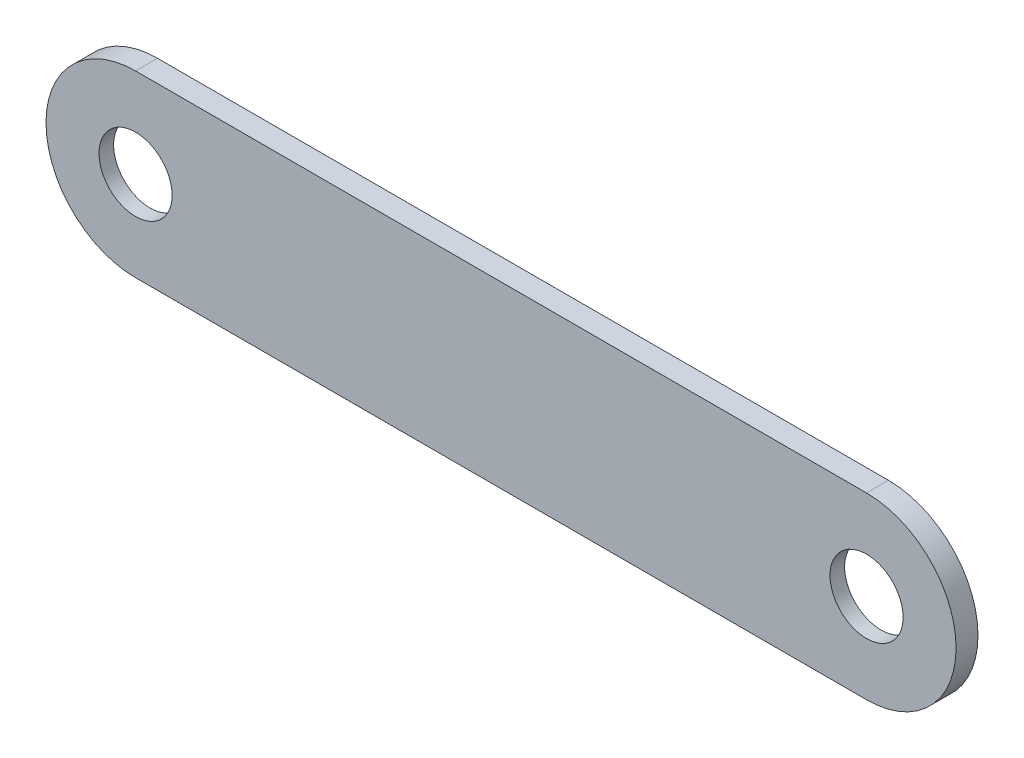
ISO-10303-21;
HEADER;
FILE_DESCRIPTION(('STEP AP214'),'2;1');
FILE_NAME('part.step','',(''),(''),'','','');
FILE_SCHEMA(('AUTOMOTIVE_DESIGN { 1 0 10303 214 1 1 1 1 }'));
ENDSEC;
DATA;
#1=APPLICATION_CONTEXT('core data for automotive mechanical design processes');
#2=APPLICATION_PROTOCOL_DEFINITION('international standard','automotive_design',2000,#1);
#3=PRODUCT_CONTEXT('',#1,'mechanical');
#4=PRODUCT('Part','Part','',(#3));
#5=PRODUCT_RELATED_PRODUCT_CATEGORY('part','',(#4));
#6=PRODUCT_DEFINITION_FORMATION('','',#4);
#7=PRODUCT_DEFINITION_CONTEXT('part definition',#1,'design');
#8=PRODUCT_DEFINITION('design','',#6,#7);
#9=PRODUCT_DEFINITION_SHAPE('','',#8);
#10=(LENGTH_UNIT() NAMED_UNIT(*) SI_UNIT(.MILLI.,.METRE.));
#11=(NAMED_UNIT(*) PLANE_ANGLE_UNIT() SI_UNIT($,.RADIAN.));
#12=(NAMED_UNIT(*) SI_UNIT($,.STERADIAN.) SOLID_ANGLE_UNIT());
#13=UNCERTAINTY_MEASURE_WITH_UNIT(LENGTH_MEASURE(1.E-05),#10,'distance_accuracy_value','');
#14=(GEOMETRIC_REPRESENTATION_CONTEXT(3) GLOBAL_UNCERTAINTY_ASSIGNED_CONTEXT((#13)) GLOBAL_UNIT_ASSIGNED_CONTEXT((#10,
#11,#12)) REPRESENTATION_CONTEXT('',''));
#15=CARTESIAN_POINT('',(0.,0.,0.));
#16=DIRECTION('',(0.,0.,1.));
#17=DIRECTION('',(1.,0.,0.));
#18=AXIS2_PLACEMENT_3D('',#15,#16,#17);
#19=CARTESIAN_POINT('',(0.,0.,3.));
#20=DIRECTION('',(0.,0.,1.));
#21=DIRECTION('',(1.,0.,0.));
#22=AXIS2_PLACEMENT_3D('',#19,#20,#21);
#23=PLANE('',#22);
#24=CARTESIAN_POINT('',(0.,0.,3.));
#25=DIRECTION('',(0.,0.,1.));
#26=DIRECTION('',(1.,0.,0.));
#27=AXIS2_PLACEMENT_3D('',#24,#25,#26);
#28=CIRCLE('',#27,5.);
#29=CARTESIAN_POINT('',(5.,0.,3.));
#30=VERTEX_POINT('',#29);
#31=EDGE_CURVE('E117',#30,#30,#28,.T.);
#32=ORIENTED_EDGE('',*,*,#31,.F.);
#33=EDGE_LOOP('',(#32));
#34=FACE_BOUND('',#33,.T.);
#35=CARTESIAN_POINT('',(0.,0.,3.));
#36=DIRECTION('',(0.,0.,1.));
#37=DIRECTION('',(1.,0.,0.));
#38=AXIS2_PLACEMENT_3D('',#35,#36,#37);
#39=CIRCLE('',#38,12.2500000000014);
#40=CARTESIAN_POINT('',(0.,12.2500000000014,3.));
#41=VERTEX_POINT('',#40);
#42=CARTESIAN_POINT('',(0.,-12.2500000000014,3.));
#43=VERTEX_POINT('',#42);
#44=EDGE_CURVE('E96',#41,#43,#39,.T.);
#45=ORIENTED_EDGE('',*,*,#44,.T.);
#46=DIRECTION('',(1.,0.,0.));
#47=VECTOR('',#46,1.);
#48=CARTESIAN_POINT('',(0.,-12.2500000000014,3.));
#49=LINE('',#48,#47);
#50=CARTESIAN_POINT('',(100.,-12.25,3.));
#51=VERTEX_POINT('',#50);
#52=EDGE_CURVE('E91',#43,#51,#49,.T.);
#53=ORIENTED_EDGE('',*,*,#52,.T.);
#54=CARTESIAN_POINT('',(100.,1.39659253553725E-12,3.));
#55=DIRECTION('',(0.,0.,1.));
#56=DIRECTION('',(1.,0.,0.));
#57=AXIS2_PLACEMENT_3D('',#54,#55,#56);
#58=CIRCLE('',#57,12.2500000000014);
#59=CARTESIAN_POINT('',(100.,12.2500000000014,3.));
#60=VERTEX_POINT('',#59);
#61=EDGE_CURVE('E94',#51,#60,#58,.T.);
#62=ORIENTED_EDGE('',*,*,#61,.T.);
#63=DIRECTION('',(-1.,0.,0.));
#64=VECTOR('',#63,1.);
#65=CARTESIAN_POINT('',(0.,12.2500000000014,3.));
#66=LINE('',#65,#64);
#67=EDGE_CURVE('E61',#60,#41,#66,.T.);
#68=ORIENTED_EDGE('',*,*,#67,.T.);
#69=EDGE_LOOP('',(#45,#53,#62,#68));
#70=FACE_BOUND('',#69,.T.);
#71=CARTESIAN_POINT('',(100.,1.39659253553725E-12,3.));
#72=DIRECTION('',(0.,0.,1.));
#73=DIRECTION('',(1.,0.,0.));
#74=AXIS2_PLACEMENT_3D('',#71,#72,#73);
#75=CIRCLE('',#74,5.);
#76=CARTESIAN_POINT('',(105.,1.39659253553725E-12,3.));
#77=VERTEX_POINT('',#76);
#78=EDGE_CURVE('E143',#77,#77,#75,.T.);
#79=ORIENTED_EDGE('',*,*,#78,.F.);
#80=EDGE_LOOP('',(#79));
#81=FACE_BOUND('',#80,.T.);
#82=ADVANCED_FACE('F41',(#34,#70,#81),#23,.T.);
#83=CARTESIAN_POINT('',(0.,0.,0.));
#84=DIRECTION('',(0.,0.,1.));
#85=DIRECTION('',(1.,0.,0.));
#86=AXIS2_PLACEMENT_3D('',#83,#84,#85);
#87=PLANE('',#86);
#88=CARTESIAN_POINT('',(0.,0.,0.));
#89=DIRECTION('',(0.,0.,1.));
#90=DIRECTION('',(1.,0.,0.));
#91=AXIS2_PLACEMENT_3D('',#88,#89,#90);
#92=CIRCLE('',#91,7.5);
#93=CARTESIAN_POINT('',(7.5,0.,0.));
#94=VERTEX_POINT('',#93);
#95=EDGE_CURVE('E45',#94,#94,#92,.T.);
#96=ORIENTED_EDGE('',*,*,#95,.T.);
#97=EDGE_LOOP('',(#96));
#98=FACE_BOUND('',#97,.T.);
#99=CARTESIAN_POINT('',(100.,1.39659253553725E-12,0.));
#100=DIRECTION('',(0.,0.,1.));
#101=DIRECTION('',(1.,0.,0.));
#102=AXIS2_PLACEMENT_3D('',#99,#100,#101);
#103=CIRCLE('',#102,7.5);
#104=CARTESIAN_POINT('',(107.5,1.39659253553725E-12,0.));
#105=VERTEX_POINT('',#104);
#106=EDGE_CURVE('E136',#105,#105,#103,.T.);
#107=ORIENTED_EDGE('',*,*,#106,.T.);
#108=EDGE_LOOP('',(#107));
#109=FACE_BOUND('',#108,.T.);
#110=CARTESIAN_POINT('',(0.,0.,0.));
#111=DIRECTION('',(0.,0.,1.));
#112=DIRECTION('',(1.,0.,0.));
#113=AXIS2_PLACEMENT_3D('',#110,#111,#112);
#114=CIRCLE('',#113,12.2500000000014);
#115=CARTESIAN_POINT('',(0.,12.2500000000014,0.));
#116=VERTEX_POINT('',#115);
#117=CARTESIAN_POINT('',(0.,-12.2500000000014,0.));
#118=VERTEX_POINT('',#117);
#119=EDGE_CURVE('E113',#116,#118,#114,.T.);
#120=ORIENTED_EDGE('',*,*,#119,.F.);
#121=DIRECTION('',(-1.,0.,0.));
#122=VECTOR('',#121,1.);
#123=CARTESIAN_POINT('',(0.,12.2500000000014,0.));
#124=LINE('',#123,#122);
#125=CARTESIAN_POINT('',(100.,12.2500000000014,0.));
#126=VERTEX_POINT('',#125);
#127=EDGE_CURVE('E84',#126,#116,#124,.T.);
#128=ORIENTED_EDGE('',*,*,#127,.F.);
#129=CARTESIAN_POINT('',(100.,1.39659253553725E-12,0.));
#130=DIRECTION('',(0.,0.,1.));
#131=DIRECTION('',(1.,0.,0.));
#132=AXIS2_PLACEMENT_3D('',#129,#130,#131);
#133=CIRCLE('',#132,12.2500000000014);
#134=CARTESIAN_POINT('',(100.,-12.25,0.));
#135=VERTEX_POINT('',#134);
#136=EDGE_CURVE('E78',#135,#126,#133,.T.);
#137=ORIENTED_EDGE('',*,*,#136,.F.);
#138=DIRECTION('',(1.,0.,0.));
#139=VECTOR('',#138,1.);
#140=CARTESIAN_POINT('',(0.,-12.2500000000014,0.));
#141=LINE('',#140,#139);
#142=EDGE_CURVE('E101',#118,#135,#141,.T.);
#143=ORIENTED_EDGE('',*,*,#142,.F.);
#144=EDGE_LOOP('',(#120,#128,#137,#143));
#145=FACE_BOUND('',#144,.T.);
#146=ADVANCED_FACE('F177',(#98,#109,#145),#87,.F.);
#147=CARTESIAN_POINT('',(0.,0.,3.));
#148=DIRECTION('',(0.,0.,-1.));
#149=DIRECTION('',(-1.,0.,0.));
#150=AXIS2_PLACEMENT_3D('',#147,#148,#149);
#151=CYLINDRICAL_SURFACE('',#150,12.2500000000014);
#152=ORIENTED_EDGE('',*,*,#119,.T.);
#153=DIRECTION('',(0.,0.,-1.));
#154=VECTOR('',#153,1.);
#155=CARTESIAN_POINT('',(0.,-12.2500000000014,3.));
#156=LINE('',#155,#154);
#157=EDGE_CURVE('E11',#43,#118,#156,.T.);
#158=ORIENTED_EDGE('',*,*,#157,.F.);
#159=ORIENTED_EDGE('',*,*,#44,.F.);
#160=DIRECTION('',(0.,0.,-1.));
#161=VECTOR('',#160,1.);
#162=CARTESIAN_POINT('',(0.,12.2500000000014,3.));
#163=LINE('',#162,#161);
#164=EDGE_CURVE('E109',#41,#116,#163,.T.);
#165=ORIENTED_EDGE('',*,*,#164,.T.);
#166=EDGE_LOOP('',(#152,#158,#159,#165));
#167=FACE_BOUND('',#166,.T.);
#168=ADVANCED_FACE('F43',(#167),#151,.T.);
#169=CARTESIAN_POINT('',(0.,-12.2500000000014,3.));
#170=DIRECTION('',(0.,1.,0.));
#171=DIRECTION('',(0.,0.,1.));
#172=AXIS2_PLACEMENT_3D('',#169,#170,#171);
#173=PLANE('',#172);
#174=ORIENTED_EDGE('',*,*,#142,.T.);
#175=DIRECTION('',(0.,0.,-1.));
#176=VECTOR('',#175,1.);
#177=CARTESIAN_POINT('',(100.,-12.25,3.));
#178=LINE('',#177,#176);
#179=EDGE_CURVE('E52',#51,#135,#178,.T.);
#180=ORIENTED_EDGE('',*,*,#179,.F.);
#181=ORIENTED_EDGE('',*,*,#52,.F.);
#182=ORIENTED_EDGE('',*,*,#157,.T.);
#183=EDGE_LOOP('',(#174,#180,#181,#182));
#184=FACE_BOUND('',#183,.T.);
#185=ADVANCED_FACE('F100',(#184),#173,.F.);
#186=CARTESIAN_POINT('',(100.,1.39659253553725E-12,3.));
#187=DIRECTION('',(0.,0.,-1.));
#188=DIRECTION('',(-1.,0.,0.));
#189=AXIS2_PLACEMENT_3D('',#186,#187,#188);
#190=CYLINDRICAL_SURFACE('',#189,12.2500000000014);
#191=ORIENTED_EDGE('',*,*,#136,.T.);
#192=DIRECTION('',(0.,0.,-1.));
#193=VECTOR('',#192,1.);
#194=CARTESIAN_POINT('',(100.,12.2500000000014,3.));
#195=LINE('',#194,#193);
#196=EDGE_CURVE('E103',#60,#126,#195,.T.);
#197=ORIENTED_EDGE('',*,*,#196,.F.);
#198=ORIENTED_EDGE('',*,*,#61,.F.);
#199=ORIENTED_EDGE('',*,*,#179,.T.);
#200=EDGE_LOOP('',(#191,#197,#198,#199));
#201=FACE_BOUND('',#200,.T.);
#202=ADVANCED_FACE('F105',(#201),#190,.T.);
#203=CARTESIAN_POINT('',(0.,12.2500000000014,3.));
#204=DIRECTION('',(0.,-1.,0.));
#205=DIRECTION('',(0.,0.,-1.));
#206=AXIS2_PLACEMENT_3D('',#203,#204,#205);
#207=PLANE('',#206);
#208=ORIENTED_EDGE('',*,*,#127,.T.);
#209=ORIENTED_EDGE('',*,*,#164,.F.);
#210=ORIENTED_EDGE('',*,*,#67,.F.);
#211=ORIENTED_EDGE('',*,*,#196,.T.);
#212=EDGE_LOOP('',(#208,#209,#210,#211));
#213=FACE_BOUND('',#212,.T.);
#214=ADVANCED_FACE('F189',(#213),#207,.F.);
#215=CARTESIAN_POINT('',(0.,0.,3.));
#216=DIRECTION('',(0.,0.,-1.));
#217=DIRECTION('',(-1.,0.,0.));
#218=AXIS2_PLACEMENT_3D('',#215,#216,#217);
#219=CYLINDRICAL_SURFACE('',#218,5.);
#220=CARTESIAN_POINT('',(0.,0.,1.));
#221=DIRECTION('',(0.,0.,1.));
#222=DIRECTION('',(1.,0.,0.));
#223=AXIS2_PLACEMENT_3D('',#220,#221,#222);
#224=CIRCLE('',#223,5.);
#225=CARTESIAN_POINT('',(5.,0.,1.));
#226=VERTEX_POINT('',#225);
#227=EDGE_CURVE('E132',#226,#226,#224,.T.);
#228=ORIENTED_EDGE('',*,*,#227,.F.);
#229=EDGE_LOOP('',(#228));
#230=FACE_BOUND('',#229,.T.);
#231=ORIENTED_EDGE('',*,*,#31,.T.);
#232=EDGE_LOOP('',(#231));
#233=FACE_BOUND('',#232,.T.);
#234=ADVANCED_FACE('F186',(#230,#233),#219,.F.);
#235=CARTESIAN_POINT('',(100.,1.39659253553725E-12,3.));
#236=DIRECTION('',(0.,0.,-1.));
#237=DIRECTION('',(-1.,0.,0.));
#238=AXIS2_PLACEMENT_3D('',#235,#236,#237);
#239=CYLINDRICAL_SURFACE('',#238,5.);
#240=CARTESIAN_POINT('',(100.,1.39659253553725E-12,1.));
#241=DIRECTION('',(0.,0.,1.));
#242=DIRECTION('',(1.,0.,0.));
#243=AXIS2_PLACEMENT_3D('',#240,#241,#242);
#244=CIRCLE('',#243,5.);
#245=CARTESIAN_POINT('',(105.,1.39659253553725E-12,1.));
#246=VERTEX_POINT('',#245);
#247=EDGE_CURVE('E128',#246,#246,#244,.T.);
#248=ORIENTED_EDGE('',*,*,#247,.F.);
#249=EDGE_LOOP('',(#248));
#250=FACE_BOUND('',#249,.T.);
#251=ORIENTED_EDGE('',*,*,#78,.T.);
#252=EDGE_LOOP('',(#251));
#253=FACE_BOUND('',#252,.T.);
#254=ADVANCED_FACE('F220',(#250,#253),#239,.F.);
#255=CARTESIAN_POINT('',(100.,1.39659253553725E-12,-2.));
#256=DIRECTION('',(0.,0.,1.));
#257=DIRECTION('',(1.,0.,0.));
#258=AXIS2_PLACEMENT_3D('',#255,#256,#257);
#259=CYLINDRICAL_SURFACE('',#258,7.5);
#260=CARTESIAN_POINT('',(100.,1.39659253553725E-12,1.));
#261=DIRECTION('',(0.,0.,1.));
#262=DIRECTION('',(1.,0.,0.));
#263=AXIS2_PLACEMENT_3D('',#260,#261,#262);
#264=CIRCLE('',#263,7.5);
#265=CARTESIAN_POINT('',(107.5,1.39659253553725E-12,1.));
#266=VERTEX_POINT('',#265);
#267=EDGE_CURVE('E155',#266,#266,#264,.T.);
#268=ORIENTED_EDGE('',*,*,#267,.T.);
#269=EDGE_LOOP('',(#268));
#270=FACE_BOUND('',#269,.T.);
#271=ORIENTED_EDGE('',*,*,#106,.F.);
#272=EDGE_LOOP('',(#271));
#273=FACE_BOUND('',#272,.T.);
#274=ADVANCED_FACE('F229',(#270,#273),#259,.F.);
#275=CARTESIAN_POINT('',(100.,1.39659253553725E-12,1.));
#276=DIRECTION('',(0.,0.,1.));
#277=DIRECTION('',(1.,0.,0.));
#278=AXIS2_PLACEMENT_3D('',#275,#276,#277);
#279=PLANE('',#278);
#280=ORIENTED_EDGE('',*,*,#247,.T.);
#281=EDGE_LOOP('',(#280));
#282=FACE_BOUND('',#281,.T.);
#283=ORIENTED_EDGE('',*,*,#267,.F.);
#284=EDGE_LOOP('',(#283));
#285=FACE_BOUND('',#284,.T.);
#286=ADVANCED_FACE('F174',(#282,#285),#279,.F.);
#287=CARTESIAN_POINT('',(0.,0.,-2.));
#288=DIRECTION('',(0.,0.,1.));
#289=DIRECTION('',(1.,0.,0.));
#290=AXIS2_PLACEMENT_3D('',#287,#288,#289);
#291=CYLINDRICAL_SURFACE('',#290,7.5);
#292=CARTESIAN_POINT('',(0.,0.,1.));
#293=DIRECTION('',(0.,0.,1.));
#294=DIRECTION('',(1.,0.,0.));
#295=AXIS2_PLACEMENT_3D('',#292,#293,#294);
#296=CIRCLE('',#295,7.5);
#297=CARTESIAN_POINT('',(7.5,0.,1.));
#298=VERTEX_POINT('',#297);
#299=EDGE_CURVE('E133',#298,#298,#296,.T.);
#300=ORIENTED_EDGE('',*,*,#299,.T.);
#301=EDGE_LOOP('',(#300));
#302=FACE_BOUND('',#301,.T.);
#303=ORIENTED_EDGE('',*,*,#95,.F.);
#304=EDGE_LOOP('',(#303));
#305=FACE_BOUND('',#304,.T.);
#306=ADVANCED_FACE('F164',(#302,#305),#291,.F.);
#307=CARTESIAN_POINT('',(0.,0.,1.));
#308=DIRECTION('',(0.,0.,1.));
#309=DIRECTION('',(1.,0.,0.));
#310=AXIS2_PLACEMENT_3D('',#307,#308,#309);
#311=PLANE('',#310);
#312=ORIENTED_EDGE('',*,*,#227,.T.);
#313=EDGE_LOOP('',(#312));
#314=FACE_BOUND('',#313,.T.);
#315=ORIENTED_EDGE('',*,*,#299,.F.);
#316=EDGE_LOOP('',(#315));
#317=FACE_BOUND('',#316,.T.);
#318=ADVANCED_FACE('F167',(#314,#317),#311,.F.);
#319=CLOSED_SHELL('',(#82,#146,#168,#185,#202,#214,#234,#254,#274,#286,#306,#318));
#320=MANIFOLD_SOLID_BREP('B2',#319);
#321=ADVANCED_BREP_SHAPE_REPRESENTATION('',(#18,#320),#14);
#322=SHAPE_DEFINITION_REPRESENTATION(#9,#321);
ENDSEC;
END-ISO-10303-21;
